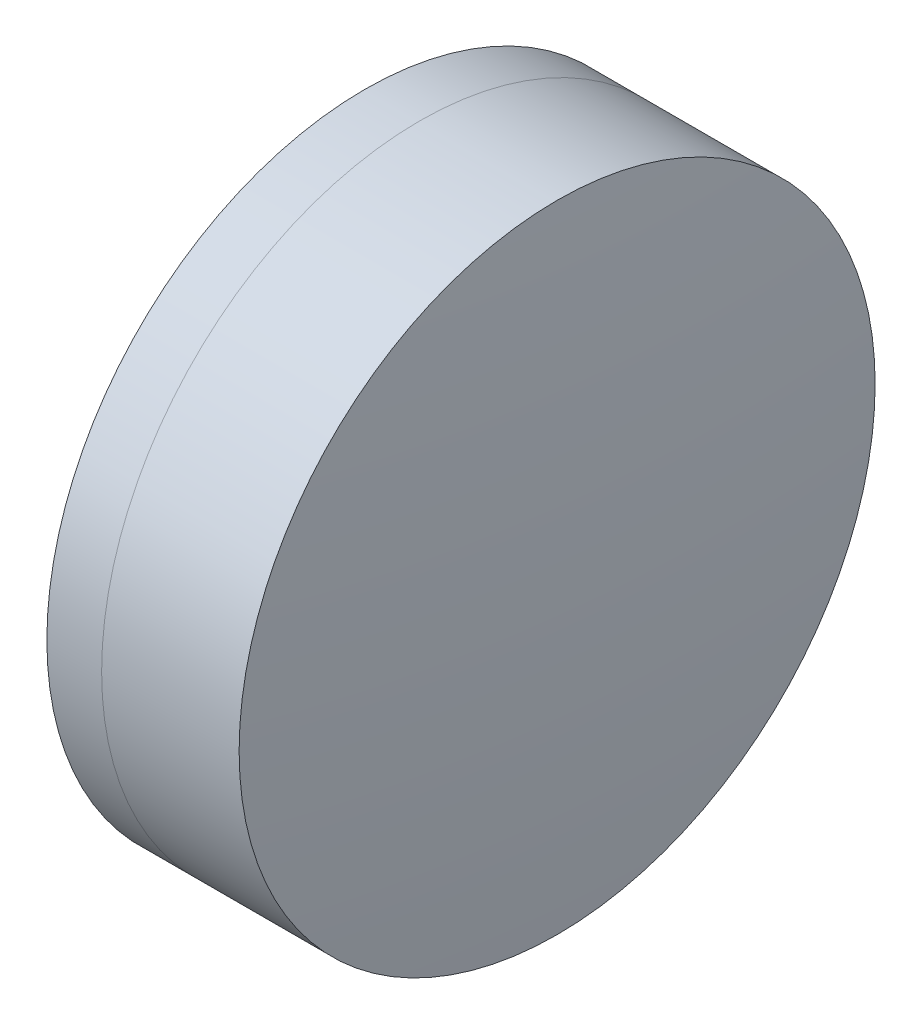
ISO-10303-21;
HEADER;
FILE_DESCRIPTION(('STEP AP214'),'2;1');
FILE_NAME('part.step','',(''),(''),'','','');
FILE_SCHEMA(('AUTOMOTIVE_DESIGN { 1 0 10303 214 1 1 1 1 }'));
ENDSEC;
DATA;
#1=APPLICATION_CONTEXT('core data for automotive mechanical design processes');
#2=APPLICATION_PROTOCOL_DEFINITION('international standard','automotive_design',2000,#1);
#3=PRODUCT_CONTEXT('',#1,'mechanical');
#4=PRODUCT('Part','Part','',(#3));
#5=PRODUCT_RELATED_PRODUCT_CATEGORY('part','',(#4));
#6=PRODUCT_DEFINITION_FORMATION('','',#4);
#7=PRODUCT_DEFINITION_CONTEXT('part definition',#1,'design');
#8=PRODUCT_DEFINITION('design','',#6,#7);
#9=PRODUCT_DEFINITION_SHAPE('','',#8);
#10=(LENGTH_UNIT() NAMED_UNIT(*) SI_UNIT(.MILLI.,.METRE.));
#11=(NAMED_UNIT(*) PLANE_ANGLE_UNIT() SI_UNIT($,.RADIAN.));
#12=(NAMED_UNIT(*) SI_UNIT($,.STERADIAN.) SOLID_ANGLE_UNIT());
#13=UNCERTAINTY_MEASURE_WITH_UNIT(LENGTH_MEASURE(1.E-05),#10,'distance_accuracy_value','');
#14=(GEOMETRIC_REPRESENTATION_CONTEXT(3) GLOBAL_UNCERTAINTY_ASSIGNED_CONTEXT((#13)) GLOBAL_UNIT_ASSIGNED_CONTEXT((#10,
#11,#12)) REPRESENTATION_CONTEXT('',''));
#15=CARTESIAN_POINT('',(0.,0.,0.));
#16=DIRECTION('',(0.,0.,1.));
#17=DIRECTION('',(1.,0.,0.));
#18=AXIS2_PLACEMENT_3D('',#15,#16,#17);
#19=CARTESIAN_POINT('',(8.33023858577234,0.,0.));
#20=DIRECTION('',(-1.,0.,0.));
#21=DIRECTION('',(0.,0.,-1.));
#22=AXIS2_PLACEMENT_3D('',#19,#20,#21);
#23=SPHERICAL_SURFACE('',#22,21.09);
#24=CARTESIAN_POINT('',(25.1676404043428,0.,0.));
#25=DIRECTION('',(-1.,0.,0.));
#26=DIRECTION('',(0.,0.,1.));
#27=AXIS2_PLACEMENT_3D('',#24,#25,#26);
#28=CIRCLE('',#27,12.7);
#29=CARTESIAN_POINT('',(25.1676404043428,0.,12.7));
#30=VERTEX_POINT('',#29);
#31=EDGE_CURVE('E51',#30,#30,#28,.T.);
#32=ORIENTED_EDGE('',*,*,#31,.T.);
#33=EDGE_LOOP('',(#32));
#34=FACE_BOUND('',#33,.T.);
#35=ADVANCED_FACE('F45',(#34),#23,.F.);
#36=CARTESIAN_POINT('',(-112.699761414228,0.,0.));
#37=DIRECTION('',(-1.,0.,0.));
#38=DIRECTION('',(0.,0.,-1.));
#39=AXIS2_PLACEMENT_3D('',#36,#37,#38);
#40=SPHERICAL_SURFACE('',#39,143.92);
#41=CARTESIAN_POINT('',(30.6587974512966,0.,0.));
#42=DIRECTION('',(-1.,0.,0.));
#43=DIRECTION('',(0.,0.,1.));
#44=AXIS2_PLACEMENT_3D('',#41,#42,#43);
#45=CIRCLE('',#44,12.7);
#46=CARTESIAN_POINT('',(30.6587974512966,0.,12.7));
#47=VERTEX_POINT('',#46);
#48=EDGE_CURVE('E11',#47,#47,#45,.T.);
#49=ORIENTED_EDGE('',*,*,#48,.F.);
#50=EDGE_LOOP('',(#49));
#51=FACE_BOUND('',#50,.T.);
#52=ADVANCED_FACE('F60',(#51),#40,.T.);
#53=CARTESIAN_POINT('',(-0.551919992657797,0.,0.));
#54=DIRECTION('',(-1.,0.,0.));
#55=DIRECTION('',(0.,0.,1.));
#56=AXIS2_PLACEMENT_3D('',#53,#54,#55);
#57=CYLINDRICAL_SURFACE('',#56,12.7);
#58=ORIENTED_EDGE('',*,*,#48,.T.);
#59=EDGE_LOOP('',(#58));
#60=FACE_BOUND('',#59,.T.);
#61=ORIENTED_EDGE('',*,*,#31,.F.);
#62=EDGE_LOOP('',(#61));
#63=FACE_BOUND('',#62,.T.);
#64=ADVANCED_FACE('F58',(#60,#63),#57,.T.);
#65=CLOSED_SHELL('',(#35,#52,#64));
#66=MANIFOLD_SOLID_BREP('B2',#65);
#67=CARTESIAN_POINT('',(43.8502385857723,0.,0.));
#68=DIRECTION('',(-1.,0.,0.));
#69=DIRECTION('',(0.,0.,1.));
#70=AXIS2_PLACEMENT_3D('',#67,#68,#69);
#71=SPHERICAL_SURFACE('',#70,24.43);
#72=CARTESIAN_POINT('',(22.9807656647808,0.,0.));
#73=DIRECTION('',(-1.,0.,0.));
#74=DIRECTION('',(0.,0.,1.));
#75=AXIS2_PLACEMENT_3D('',#72,#73,#74);
#76=CIRCLE('',#75,12.7);
#77=CARTESIAN_POINT('',(22.9807656647808,0.,12.7));
#78=VERTEX_POINT('',#77);
#79=EDGE_CURVE('E44',#78,#78,#76,.T.);
#80=ORIENTED_EDGE('',*,*,#79,.T.);
#81=EDGE_LOOP('',(#80));
#82=FACE_BOUND('',#81,.T.);
#83=ADVANCED_FACE('F86',(#82),#71,.T.);
#84=CARTESIAN_POINT('',(-0.816062176165804,0.,0.));
#85=DIRECTION('',(-1.,0.,0.));
#86=DIRECTION('',(0.,0.,1.));
#87=AXIS2_PLACEMENT_3D('',#84,#85,#86);
#88=CYLINDRICAL_SURFACE('',#87,12.7);
#89=CARTESIAN_POINT('',(25.1676404043428,0.,0.));
#90=DIRECTION('',(-1.,0.,0.));
#91=DIRECTION('',(0.,0.,1.));
#92=AXIS2_PLACEMENT_3D('',#89,#90,#91);
#93=CIRCLE('',#92,12.7);
#94=CARTESIAN_POINT('',(25.1676404043428,0.,12.7));
#95=VERTEX_POINT('',#94);
#96=EDGE_CURVE('E92',#95,#95,#93,.T.);
#97=ORIENTED_EDGE('',*,*,#96,.T.);
#98=EDGE_LOOP('',(#97));
#99=FACE_BOUND('',#98,.T.);
#100=ORIENTED_EDGE('',*,*,#79,.F.);
#101=EDGE_LOOP('',(#100));
#102=FACE_BOUND('',#101,.T.);
#103=ADVANCED_FACE('F98',(#99,#102),#88,.T.);
#104=CARTESIAN_POINT('',(8.33023858577234,0.,0.));
#105=DIRECTION('',(-1.,0.,0.));
#106=DIRECTION('',(0.,0.,1.));
#107=AXIS2_PLACEMENT_3D('',#104,#105,#106);
#108=SPHERICAL_SURFACE('',#107,21.09);
#109=ORIENTED_EDGE('',*,*,#96,.F.);
#110=EDGE_LOOP('',(#109));
#111=FACE_BOUND('',#110,.T.);
#112=ADVANCED_FACE('F101',(#111),#108,.T.);
#113=CLOSED_SHELL('',(#83,#103,#112));
#114=MANIFOLD_SOLID_BREP('B6',#113);
#115=ADVANCED_BREP_SHAPE_REPRESENTATION('',(#18,#66,#114),#14);
#116=SHAPE_DEFINITION_REPRESENTATION(#9,#115);
ENDSEC;
END-ISO-10303-21;
